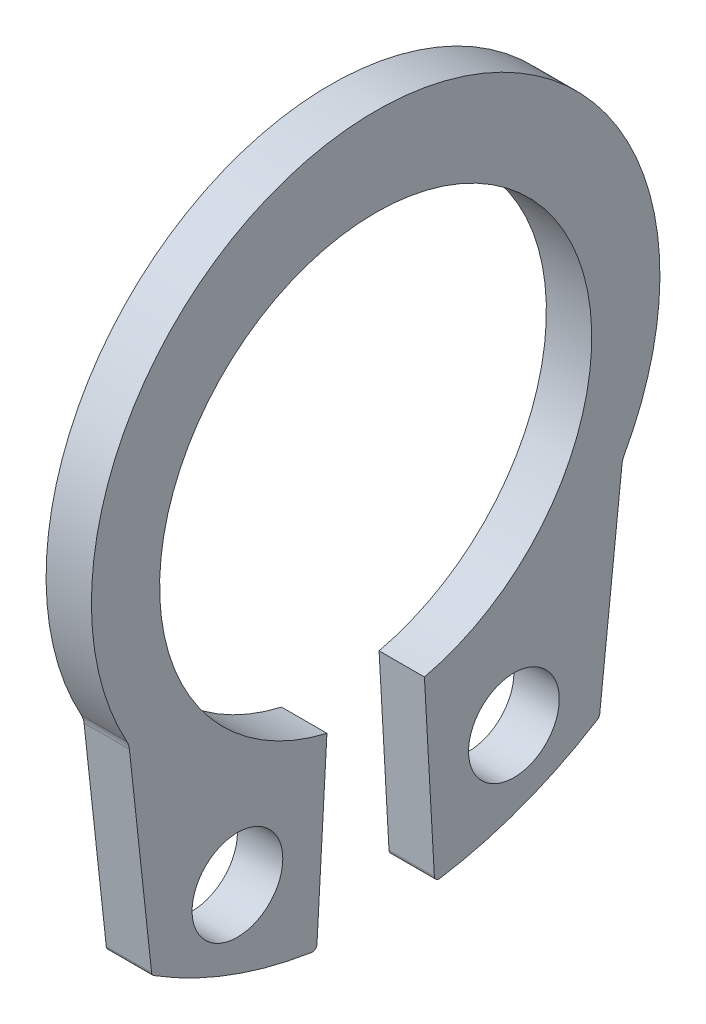
ISO-10303-21;
HEADER;
FILE_DESCRIPTION(('STEP AP214'),'2;1');
FILE_NAME('part.step','',(''),(''),'','','');
FILE_SCHEMA(('AUTOMOTIVE_DESIGN { 1 0 10303 214 1 1 1 1 }'));
ENDSEC;
DATA;
#1=APPLICATION_CONTEXT('core data for automotive mechanical design processes');
#2=APPLICATION_PROTOCOL_DEFINITION('international standard','automotive_design',2000,#1);
#3=PRODUCT_CONTEXT('',#1,'mechanical');
#4=PRODUCT('Part','Part','',(#3));
#5=PRODUCT_RELATED_PRODUCT_CATEGORY('part','',(#4));
#6=PRODUCT_DEFINITION_FORMATION('','',#4);
#7=PRODUCT_DEFINITION_CONTEXT('part definition',#1,'design');
#8=PRODUCT_DEFINITION('design','',#6,#7);
#9=PRODUCT_DEFINITION_SHAPE('','',#8);
#10=(LENGTH_UNIT() NAMED_UNIT(*) SI_UNIT(.MILLI.,.METRE.));
#11=(NAMED_UNIT(*) PLANE_ANGLE_UNIT() SI_UNIT($,.RADIAN.));
#12=(NAMED_UNIT(*) SI_UNIT($,.STERADIAN.) SOLID_ANGLE_UNIT());
#13=UNCERTAINTY_MEASURE_WITH_UNIT(LENGTH_MEASURE(1.E-05),#10,'distance_accuracy_value','');
#14=(GEOMETRIC_REPRESENTATION_CONTEXT(3) GLOBAL_UNCERTAINTY_ASSIGNED_CONTEXT((#13)) GLOBAL_UNIT_ASSIGNED_CONTEXT((#10,
#11,#12)) REPRESENTATION_CONTEXT('',''));
#15=CARTESIAN_POINT('',(0.,0.,0.));
#16=DIRECTION('',(0.,0.,1.));
#17=DIRECTION('',(1.,0.,0.));
#18=AXIS2_PLACEMENT_3D('',#15,#16,#17);
#19=CARTESIAN_POINT('',(0.85,-2.39792397685185,-5.01373537734668));
#20=DIRECTION('',(-1.,0.,0.));
#21=DIRECTION('',(0.,0.,1.));
#22=AXIS2_PLACEMENT_3D('',#19,#20,#21);
#23=CYLINDRICAL_SURFACE('',#22,0.4);
#24=CARTESIAN_POINT('',(0.85,-2.39792397685185,-5.01373537734668));
#25=DIRECTION('',(-1.,0.,0.));
#26=DIRECTION('',(0.,0.,-1.));
#27=AXIS2_PLACEMENT_3D('',#24,#25,#26);
#28=CIRCLE('',#27,0.4);
#29=CARTESIAN_POINT('',(0.85,-2.3547374993622,-4.61607355096397));
#30=VERTEX_POINT('',#29);
#31=CARTESIAN_POINT('',(0.85,-2.20449375873755,-4.6636143258227));
#32=VERTEX_POINT('',#31);
#33=EDGE_CURVE('E38',#30,#32,#28,.T.);
#34=ORIENTED_EDGE('',*,*,#33,.F.);
#35=DIRECTION('',(1.,0.,0.));
#36=VECTOR('',#35,1.);
#37=CARTESIAN_POINT('',(0.85,-2.3547374993622,-4.61607355096397));
#38=LINE('',#37,#36);
#39=CARTESIAN_POINT('',(0.,-2.3547374993622,-4.61607355096397));
#40=VERTEX_POINT('',#39);
#41=EDGE_CURVE('E248',#40,#30,#38,.T.);
#42=ORIENTED_EDGE('',*,*,#41,.F.);
#43=CARTESIAN_POINT('',(0.,-2.39792397685185,-5.01373537734668));
#44=DIRECTION('',(1.,0.,0.));
#45=DIRECTION('',(0.,0.,-1.));
#46=AXIS2_PLACEMENT_3D('',#43,#44,#45);
#47=CIRCLE('',#46,0.4);
#48=CARTESIAN_POINT('',(0.,-2.20449375873755,-4.6636143258227));
#49=VERTEX_POINT('',#48);
#50=EDGE_CURVE('E11',#49,#40,#47,.T.);
#51=ORIENTED_EDGE('',*,*,#50,.F.);
#52=DIRECTION('',(-1.,0.,0.));
#53=VECTOR('',#52,1.);
#54=CARTESIAN_POINT('',(0.85,-2.20449375873755,-4.6636143258227));
#55=LINE('',#54,#53);
#56=EDGE_CURVE('E279',#32,#49,#55,.T.);
#57=ORIENTED_EDGE('',*,*,#56,.F.);
#58=EDGE_LOOP('',(#34,#42,#51,#57));
#59=FACE_BOUND('',#58,.T.);
#60=ADVANCED_FACE('F17',(#59),#23,.F.);
#61=CARTESIAN_POINT('',(0.85,-2.39792397685184,5.01373537734669));
#62=DIRECTION('',(-1.,0.,0.));
#63=DIRECTION('',(0.,0.,1.));
#64=AXIS2_PLACEMENT_3D('',#61,#62,#63);
#65=CYLINDRICAL_SURFACE('',#64,0.4);
#66=CARTESIAN_POINT('',(0.85,-2.39792397685184,5.01373537734669));
#67=DIRECTION('',(-1.,0.,0.));
#68=DIRECTION('',(0.,0.,-1.));
#69=AXIS2_PLACEMENT_3D('',#66,#67,#68);
#70=CIRCLE('',#69,0.4);
#71=CARTESIAN_POINT('',(0.85,-2.20449375873754,4.66361432582271));
#72=VERTEX_POINT('',#71);
#73=CARTESIAN_POINT('',(0.85,-2.35473749936219,4.61607355096397));
#74=VERTEX_POINT('',#73);
#75=EDGE_CURVE('E256',#72,#74,#70,.T.);
#76=ORIENTED_EDGE('',*,*,#75,.F.);
#77=DIRECTION('',(1.,0.,0.));
#78=VECTOR('',#77,1.);
#79=CARTESIAN_POINT('',(0.85,-2.20449375873754,4.66361432582271));
#80=LINE('',#79,#78);
#81=CARTESIAN_POINT('',(0.,-2.20449375873754,4.66361432582271));
#82=VERTEX_POINT('',#81);
#83=EDGE_CURVE('E271',#82,#72,#80,.T.);
#84=ORIENTED_EDGE('',*,*,#83,.F.);
#85=CARTESIAN_POINT('',(0.,-2.39792397685184,5.01373537734669));
#86=DIRECTION('',(1.,0.,0.));
#87=DIRECTION('',(0.,0.,-1.));
#88=AXIS2_PLACEMENT_3D('',#85,#86,#87);
#89=CIRCLE('',#88,0.4);
#90=CARTESIAN_POINT('',(0.,-2.35473749936219,4.61607355096397));
#91=VERTEX_POINT('',#90);
#92=EDGE_CURVE('E20',#91,#82,#89,.T.);
#93=ORIENTED_EDGE('',*,*,#92,.F.);
#94=DIRECTION('',(-1.,0.,0.));
#95=VECTOR('',#94,1.);
#96=CARTESIAN_POINT('',(0.85,-2.35473749936219,4.61607355096397));
#97=LINE('',#96,#95);
#98=EDGE_CURVE('E176',#74,#91,#97,.T.);
#99=ORIENTED_EDGE('',*,*,#98,.F.);
#100=EDGE_LOOP('',(#76,#84,#93,#99));
#101=FACE_BOUND('',#100,.T.);
#102=ADVANCED_FACE('F272',(#101),#65,.F.);
#103=CARTESIAN_POINT('',(0.,0.,0.));
#104=DIRECTION('',(1.,0.,0.));
#105=DIRECTION('',(0.,1.,0.));
#106=AXIS2_PLACEMENT_3D('',#103,#104,#105);
#107=PLANE('',#106);
#108=CARTESIAN_POINT('',(0.,-5.56782224250959,2.59106511830008));
#109=DIRECTION('',(1.,0.,0.));
#110=DIRECTION('',(0.,0.,-1.));
#111=AXIS2_PLACEMENT_3D('',#108,#109,#110);
#112=CIRCLE('',#111,0.85);
#113=CARTESIAN_POINT('',(0.,-5.56782224250959,1.74106511830008));
#114=VERTEX_POINT('',#113);
#115=EDGE_CURVE('E315',#114,#114,#112,.T.);
#116=ORIENTED_EDGE('',*,*,#115,.T.);
#117=EDGE_LOOP('',(#116));
#118=FACE_BOUND('',#117,.T.);
#119=CARTESIAN_POINT('',(0.,-5.56782224250959,-2.59106511830008));
#120=DIRECTION('',(-1.,0.,0.));
#121=DIRECTION('',(0.,0.,-1.));
#122=AXIS2_PLACEMENT_3D('',#119,#120,#121);
#123=CIRCLE('',#122,0.85);
#124=CARTESIAN_POINT('',(0.,-5.56782224250959,-3.44106511830008));
#125=VERTEX_POINT('',#124);
#126=EDGE_CURVE('E353',#125,#125,#123,.T.);
#127=ORIENTED_EDGE('',*,*,#126,.F.);
#128=EDGE_LOOP('',(#127));
#129=FACE_BOUND('',#128,.T.);
#130=DIRECTION('',(0.,0.994154565956785,0.107966193724127));
#131=VECTOR('',#130,1.);
#132=CARTESIAN_POINT('',(0.,-0.522915110689556,4.81501131945199));
#133=LINE('',#132,#131);
#134=CARTESIAN_POINT('',(0.,-6.19075573329271,4.19947808185275));
#135=VERTEX_POINT('',#134);
#136=EDGE_CURVE('E154',#135,#91,#133,.T.);
#137=ORIENTED_EDGE('',*,*,#136,.T.);
#138=ORIENTED_EDGE('',*,*,#92,.T.);
#139=CARTESIAN_POINT('',(0.,0.371997807017542,0.));
#140=DIRECTION('',(1.,0.,0.));
#141=DIRECTION('',(0.,0.,-1.));
#142=AXIS2_PLACEMENT_3D('',#139,#140,#141);
#143=CIRCLE('',#142,5.32800219298246);
#144=EDGE_CURVE('E267',#49,#82,#143,.T.);
#145=ORIENTED_EDGE('',*,*,#144,.F.);
#146=ORIENTED_EDGE('',*,*,#50,.T.);
#147=DIRECTION('',(0.,0.994154565956785,-0.107966193724126));
#148=VECTOR('',#147,1.);
#149=CARTESIAN_POINT('',(0.,-0.522915110689551,-4.81501131945199));
#150=LINE('',#149,#148);
#151=CARTESIAN_POINT('',(0.,-6.19075573329271,-4.19947808185275));
#152=VERTEX_POINT('',#151);
#153=EDGE_CURVE('E244',#152,#40,#150,.T.);
#154=ORIENTED_EDGE('',*,*,#153,.F.);
#155=CARTESIAN_POINT('',(0.,-6.1811158134206,-4.11071353412026));
#156=DIRECTION('',(-1.,0.,0.));
#157=DIRECTION('',(0.,0.,-1.));
#158=AXIS2_PLACEMENT_3D('',#155,#156,#157);
#159=CIRCLE('',#158,0.0892864658797376);
#160=CARTESIAN_POINT('',(0.,-6.25675257958271,-4.15815984687302));
#161=VERTEX_POINT('',#160);
#162=EDGE_CURVE('E190',#152,#161,#159,.T.);
#163=ORIENTED_EDGE('',*,*,#162,.T.);
#164=CARTESIAN_POINT('',(0.,0.371997807017542,0.));
#165=DIRECTION('',(1.,0.,0.));
#166=DIRECTION('',(0.,0.,-1.));
#167=AXIS2_PLACEMENT_3D('',#164,#165,#166);
#168=CIRCLE('',#167,7.825);
#169=CARTESIAN_POINT('',(0.,-7.35997373313335,-1.20301334252644));
#170=VERTEX_POINT('',#169);
#171=EDGE_CURVE('E232',#170,#161,#168,.T.);
#172=ORIENTED_EDGE('',*,*,#171,.F.);
#173=CARTESIAN_POINT('',(0.,-7.27174876021286,-1.18928646587975));
#174=DIRECTION('',(-1.,0.,0.));
#175=DIRECTION('',(0.,0.,-1.));
#176=AXIS2_PLACEMENT_3D('',#173,#174,#175);
#177=CIRCLE('',#176,0.0892864658797398);
#178=CARTESIAN_POINT('',(0.,-7.27674135002132,-1.1001396934407));
#179=VERTEX_POINT('',#178);
#180=EDGE_CURVE('E226',#170,#179,#177,.T.);
#181=ORIENTED_EDGE('',*,*,#180,.T.);
#182=DIRECTION('',(0.,0.998435446634371,0.0559165351575345));
#183=VECTOR('',#182,1.);
#184=CARTESIAN_POINT('',(0.,0.0386678666475541,-0.690446369716576));
#185=LINE('',#184,#183);
#186=CARTESIAN_POINT('',(0.,-3.94561359779142,-0.913582692985955));
#187=VERTEX_POINT('',#186);
#188=EDGE_CURVE('E218',#179,#187,#185,.T.);
#189=ORIENTED_EDGE('',*,*,#188,.T.);
#190=CARTESIAN_POINT('',(0.,0.,0.));
#191=DIRECTION('',(1.,0.,0.));
#192=DIRECTION('',(0.,0.,-1.));
#193=AXIS2_PLACEMENT_3D('',#190,#191,#192);
#194=CIRCLE('',#193,4.05);
#195=CARTESIAN_POINT('',(0.,-3.94561359779142,0.913582692985955));
#196=VERTEX_POINT('',#195);
#197=EDGE_CURVE('E295',#187,#196,#194,.T.);
#198=ORIENTED_EDGE('',*,*,#197,.T.);
#199=DIRECTION('',(0.,0.998435446634371,-0.0559165351575343));
#200=VECTOR('',#199,1.);
#201=CARTESIAN_POINT('',(0.,0.0386678666475539,0.690446369716574));
#202=LINE('',#201,#200);
#203=CARTESIAN_POINT('',(0.,-7.27674135002132,1.1001396934407));
#204=VERTEX_POINT('',#203);
#205=EDGE_CURVE('E217',#204,#196,#202,.T.);
#206=ORIENTED_EDGE('',*,*,#205,.F.);
#207=CARTESIAN_POINT('',(0.,-7.27174876021286,1.18928646587974));
#208=DIRECTION('',(1.,0.,0.));
#209=DIRECTION('',(0.,0.,-1.));
#210=AXIS2_PLACEMENT_3D('',#207,#208,#209);
#211=CIRCLE('',#210,0.0892864658797448);
#212=CARTESIAN_POINT('',(0.,-7.35997373313335,1.20301334252644));
#213=VERTEX_POINT('',#212);
#214=EDGE_CURVE('E205',#213,#204,#211,.T.);
#215=ORIENTED_EDGE('',*,*,#214,.F.);
#216=CARTESIAN_POINT('',(0.,0.371997807017542,0.));
#217=DIRECTION('',(1.,0.,0.));
#218=DIRECTION('',(0.,0.,-1.));
#219=AXIS2_PLACEMENT_3D('',#216,#217,#218);
#220=CIRCLE('',#219,7.825);
#221=CARTESIAN_POINT('',(0.,-6.25675257958271,4.15815984687302));
#222=VERTEX_POINT('',#221);
#223=EDGE_CURVE('E157',#222,#213,#220,.T.);
#224=ORIENTED_EDGE('',*,*,#223,.F.);
#225=CARTESIAN_POINT('',(0.,-6.1811158134206,4.11071353412026));
#226=DIRECTION('',(1.,0.,0.));
#227=DIRECTION('',(0.,0.,-1.));
#228=AXIS2_PLACEMENT_3D('',#225,#226,#227);
#229=CIRCLE('',#228,0.0892864658797463);
#230=EDGE_CURVE('E150',#135,#222,#229,.T.);
#231=ORIENTED_EDGE('',*,*,#230,.F.);
#232=EDGE_LOOP('',(#137,#138,#145,#146,#154,#163,#172,#181,#189,#198,#206,#215,#224,#231));
#233=FACE_BOUND('',#232,.T.);
#234=ADVANCED_FACE('F152',(#118,#129,#233),#107,.F.);
#235=CARTESIAN_POINT('',(0.85,0.,0.));
#236=DIRECTION('',(1.,0.,0.));
#237=DIRECTION('',(0.,1.,0.));
#238=AXIS2_PLACEMENT_3D('',#235,#236,#237);
#239=PLANE('',#238);
#240=CARTESIAN_POINT('',(0.85,-5.56782224250959,2.59106511830008));
#241=DIRECTION('',(1.,0.,0.));
#242=DIRECTION('',(0.,0.,-1.));
#243=AXIS2_PLACEMENT_3D('',#240,#241,#242);
#244=CIRCLE('',#243,0.85);
#245=CARTESIAN_POINT('',(0.85,-5.56782224250959,1.74106511830008));
#246=VERTEX_POINT('',#245);
#247=EDGE_CURVE('E319',#246,#246,#244,.T.);
#248=ORIENTED_EDGE('',*,*,#247,.F.);
#249=EDGE_LOOP('',(#248));
#250=FACE_BOUND('',#249,.T.);
#251=CARTESIAN_POINT('',(0.85,-5.56782224250959,-2.59106511830008));
#252=DIRECTION('',(-1.,0.,0.));
#253=DIRECTION('',(0.,0.,-1.));
#254=AXIS2_PLACEMENT_3D('',#251,#252,#253);
#255=CIRCLE('',#254,0.85);
#256=CARTESIAN_POINT('',(0.85,-5.56782224250959,-3.44106511830008));
#257=VERTEX_POINT('',#256);
#258=EDGE_CURVE('E349',#257,#257,#255,.T.);
#259=ORIENTED_EDGE('',*,*,#258,.T.);
#260=EDGE_LOOP('',(#259));
#261=FACE_BOUND('',#260,.T.);
#262=DIRECTION('',(0.,0.994154565956785,0.107966193724127));
#263=VECTOR('',#262,1.);
#264=CARTESIAN_POINT('',(0.85,-0.522915110689556,4.81501131945199));
#265=LINE('',#264,#263);
#266=CARTESIAN_POINT('',(0.85,-6.19075573329271,4.19947808185275));
#267=VERTEX_POINT('',#266);
#268=EDGE_CURVE('E183',#267,#74,#265,.T.);
#269=ORIENTED_EDGE('',*,*,#268,.F.);
#270=CARTESIAN_POINT('',(0.85,-6.1811158134206,4.11071353412026));
#271=DIRECTION('',(1.,0.,0.));
#272=DIRECTION('',(0.,0.,-1.));
#273=AXIS2_PLACEMENT_3D('',#270,#271,#272);
#274=CIRCLE('',#273,0.0892864658797463);
#275=CARTESIAN_POINT('',(0.85,-6.25675257958271,4.15815984687302));
#276=VERTEX_POINT('',#275);
#277=EDGE_CURVE('E168',#267,#276,#274,.T.);
#278=ORIENTED_EDGE('',*,*,#277,.T.);
#279=CARTESIAN_POINT('',(0.85,0.371997807017542,0.));
#280=DIRECTION('',(1.,0.,0.));
#281=DIRECTION('',(0.,0.,-1.));
#282=AXIS2_PLACEMENT_3D('',#279,#280,#281);
#283=CIRCLE('',#282,7.825);
#284=CARTESIAN_POINT('',(0.85,-7.35997373313335,1.20301334252644));
#285=VERTEX_POINT('',#284);
#286=EDGE_CURVE('E201',#276,#285,#283,.T.);
#287=ORIENTED_EDGE('',*,*,#286,.T.);
#288=CARTESIAN_POINT('',(0.85,-7.27174876021286,1.18928646587974));
#289=DIRECTION('',(1.,0.,0.));
#290=DIRECTION('',(0.,0.,-1.));
#291=AXIS2_PLACEMENT_3D('',#288,#289,#290);
#292=CIRCLE('',#291,0.0892864658797448);
#293=CARTESIAN_POINT('',(0.85,-7.27674135002132,1.1001396934407));
#294=VERTEX_POINT('',#293);
#295=EDGE_CURVE('E213',#285,#294,#292,.T.);
#296=ORIENTED_EDGE('',*,*,#295,.T.);
#297=DIRECTION('',(0.,0.998435446634371,-0.0559165351575343));
#298=VECTOR('',#297,1.);
#299=CARTESIAN_POINT('',(0.85,0.0386678666475539,0.690446369716574));
#300=LINE('',#299,#298);
#301=CARTESIAN_POINT('',(0.85,-3.94561359779142,0.913582692985955));
#302=VERTEX_POINT('',#301);
#303=EDGE_CURVE('E222',#294,#302,#300,.T.);
#304=ORIENTED_EDGE('',*,*,#303,.T.);
#305=CARTESIAN_POINT('',(0.85,0.,0.));
#306=DIRECTION('',(1.,0.,0.));
#307=DIRECTION('',(0.,0.,-1.));
#308=AXIS2_PLACEMENT_3D('',#305,#306,#307);
#309=CIRCLE('',#308,4.05);
#310=CARTESIAN_POINT('',(0.85,-3.94561359779142,-0.913582692985955));
#311=VERTEX_POINT('',#310);
#312=EDGE_CURVE('E276',#311,#302,#309,.T.);
#313=ORIENTED_EDGE('',*,*,#312,.F.);
#314=DIRECTION('',(0.,0.998435446634371,0.0559165351575345));
#315=VECTOR('',#314,1.);
#316=CARTESIAN_POINT('',(0.85,0.0386678666475541,-0.690446369716576));
#317=LINE('',#316,#315);
#318=CARTESIAN_POINT('',(0.85,-7.27674135002132,-1.1001396934407));
#319=VERTEX_POINT('',#318);
#320=EDGE_CURVE('E223',#319,#311,#317,.T.);
#321=ORIENTED_EDGE('',*,*,#320,.F.);
#322=CARTESIAN_POINT('',(0.85,-7.27174876021286,-1.18928646587975));
#323=DIRECTION('',(-1.,0.,0.));
#324=DIRECTION('',(0.,0.,-1.));
#325=AXIS2_PLACEMENT_3D('',#322,#323,#324);
#326=CIRCLE('',#325,0.0892864658797398);
#327=CARTESIAN_POINT('',(0.85,-7.35997373313335,-1.20301334252644));
#328=VERTEX_POINT('',#327);
#329=EDGE_CURVE('E229',#328,#319,#326,.T.);
#330=ORIENTED_EDGE('',*,*,#329,.F.);
#331=CARTESIAN_POINT('',(0.85,0.371997807017542,0.));
#332=DIRECTION('',(1.,0.,0.));
#333=DIRECTION('',(0.,0.,-1.));
#334=AXIS2_PLACEMENT_3D('',#331,#332,#333);
#335=CIRCLE('',#334,7.825);
#336=CARTESIAN_POINT('',(0.85,-6.25675257958271,-4.15815984687302));
#337=VERTEX_POINT('',#336);
#338=EDGE_CURVE('E194',#328,#337,#335,.T.);
#339=ORIENTED_EDGE('',*,*,#338,.T.);
#340=CARTESIAN_POINT('',(0.85,-6.1811158134206,-4.11071353412026));
#341=DIRECTION('',(-1.,0.,0.));
#342=DIRECTION('',(0.,0.,-1.));
#343=AXIS2_PLACEMENT_3D('',#340,#341,#342);
#344=CIRCLE('',#343,0.0892864658797376);
#345=CARTESIAN_POINT('',(0.85,-6.19075573329271,-4.19947808185275));
#346=VERTEX_POINT('',#345);
#347=EDGE_CURVE('E243',#346,#337,#344,.T.);
#348=ORIENTED_EDGE('',*,*,#347,.F.);
#349=DIRECTION('',(0.,0.994154565956785,-0.107966193724126));
#350=VECTOR('',#349,1.);
#351=CARTESIAN_POINT('',(0.85,-0.522915110689551,-4.81501131945199));
#352=LINE('',#351,#350);
#353=EDGE_CURVE('E252',#346,#30,#352,.T.);
#354=ORIENTED_EDGE('',*,*,#353,.T.);
#355=ORIENTED_EDGE('',*,*,#33,.T.);
#356=CARTESIAN_POINT('',(0.85,0.371997807017542,0.));
#357=DIRECTION('',(1.,0.,0.));
#358=DIRECTION('',(0.,0.,-1.));
#359=AXIS2_PLACEMENT_3D('',#356,#357,#358);
#360=CIRCLE('',#359,5.32800219298246);
#361=EDGE_CURVE('E285',#32,#72,#360,.T.);
#362=ORIENTED_EDGE('',*,*,#361,.T.);
#363=ORIENTED_EDGE('',*,*,#75,.T.);
#364=EDGE_LOOP('',(#269,#278,#287,#296,#304,#313,#321,#330,#339,#348,#354,#355,#362,#363));
#365=FACE_BOUND('',#364,.T.);
#366=ADVANCED_FACE('F336',(#250,#261,#365),#239,.T.);
#367=CARTESIAN_POINT('',(0.85,-0.522915110689551,-4.81501131945199));
#368=DIRECTION('',(0.,0.107966193724126,0.994154565956785));
#369=DIRECTION('',(1.,0.,0.));
#370=AXIS2_PLACEMENT_3D('',#367,#368,#369);
#371=PLANE('',#370);
#372=ORIENTED_EDGE('',*,*,#153,.T.);
#373=ORIENTED_EDGE('',*,*,#41,.T.);
#374=ORIENTED_EDGE('',*,*,#353,.F.);
#375=DIRECTION('',(-1.,0.,0.));
#376=VECTOR('',#375,1.);
#377=CARTESIAN_POINT('',(0.85,-6.19075573329271,-4.19947808185275));
#378=LINE('',#377,#376);
#379=EDGE_CURVE('E193',#346,#152,#378,.T.);
#380=ORIENTED_EDGE('',*,*,#379,.T.);
#381=EDGE_LOOP('',(#372,#373,#374,#380));
#382=FACE_BOUND('',#381,.T.);
#383=ADVANCED_FACE('F394',(#382),#371,.F.);
#384=CARTESIAN_POINT('',(0.85,-6.1811158134206,-4.11071353412026));
#385=DIRECTION('',(-1.,0.,0.));
#386=DIRECTION('',(0.,0.,1.));
#387=AXIS2_PLACEMENT_3D('',#384,#385,#386);
#388=CYLINDRICAL_SURFACE('',#387,0.0892864658797376);
#389=ORIENTED_EDGE('',*,*,#162,.F.);
#390=ORIENTED_EDGE('',*,*,#379,.F.);
#391=ORIENTED_EDGE('',*,*,#347,.T.);
#392=DIRECTION('',(-1.,0.,0.));
#393=VECTOR('',#392,1.);
#394=CARTESIAN_POINT('',(0.85,-6.25675257958271,-4.15815984687302));
#395=LINE('',#394,#393);
#396=EDGE_CURVE('E236',#337,#161,#395,.T.);
#397=ORIENTED_EDGE('',*,*,#396,.T.);
#398=EDGE_LOOP('',(#389,#390,#391,#397));
#399=FACE_BOUND('',#398,.T.);
#400=ADVANCED_FACE('F391',(#399),#388,.T.);
#401=CARTESIAN_POINT('',(0.85,0.371997807017542,0.));
#402=DIRECTION('',(-1.,0.,0.));
#403=DIRECTION('',(0.,0.,1.));
#404=AXIS2_PLACEMENT_3D('',#401,#402,#403);
#405=CYLINDRICAL_SURFACE('',#404,7.825);
#406=ORIENTED_EDGE('',*,*,#171,.T.);
#407=ORIENTED_EDGE('',*,*,#396,.F.);
#408=ORIENTED_EDGE('',*,*,#338,.F.);
#409=DIRECTION('',(-1.,0.,0.));
#410=VECTOR('',#409,1.);
#411=CARTESIAN_POINT('',(0.85,-7.35997373313335,-1.20301334252644));
#412=LINE('',#411,#410);
#413=EDGE_CURVE('E186',#328,#170,#412,.T.);
#414=ORIENTED_EDGE('',*,*,#413,.T.);
#415=EDGE_LOOP('',(#406,#407,#408,#414));
#416=FACE_BOUND('',#415,.T.);
#417=ADVANCED_FACE('F389',(#416),#405,.T.);
#418=CARTESIAN_POINT('',(0.85,-7.27174876021286,-1.18928646587975));
#419=DIRECTION('',(-1.,0.,0.));
#420=DIRECTION('',(0.,0.,1.));
#421=AXIS2_PLACEMENT_3D('',#418,#419,#420);
#422=CYLINDRICAL_SURFACE('',#421,0.0892864658797398);
#423=ORIENTED_EDGE('',*,*,#180,.F.);
#424=ORIENTED_EDGE('',*,*,#413,.F.);
#425=ORIENTED_EDGE('',*,*,#329,.T.);
#426=DIRECTION('',(-1.,0.,0.));
#427=VECTOR('',#426,1.);
#428=CARTESIAN_POINT('',(0.85,-7.27674135002132,-1.1001396934407));
#429=LINE('',#428,#427);
#430=EDGE_CURVE('E221',#319,#179,#429,.T.);
#431=ORIENTED_EDGE('',*,*,#430,.T.);
#432=EDGE_LOOP('',(#423,#424,#425,#431));
#433=FACE_BOUND('',#432,.T.);
#434=ADVANCED_FACE('F427',(#433),#422,.T.);
#435=CARTESIAN_POINT('',(0.85,0.0386678666475541,-0.690446369716576));
#436=DIRECTION('',(0.,-0.0559165351575345,0.998435446634371));
#437=DIRECTION('',(-1.,0.,0.));
#438=AXIS2_PLACEMENT_3D('',#435,#436,#437);
#439=PLANE('',#438);
#440=ORIENTED_EDGE('',*,*,#188,.F.);
#441=ORIENTED_EDGE('',*,*,#430,.F.);
#442=ORIENTED_EDGE('',*,*,#320,.T.);
#443=DIRECTION('',(-1.,0.,0.));
#444=VECTOR('',#443,1.);
#445=CARTESIAN_POINT('',(0.85,-3.94561359779142,-0.913582692985955));
#446=LINE('',#445,#444);
#447=EDGE_CURVE('E292',#311,#187,#446,.T.);
#448=ORIENTED_EDGE('',*,*,#447,.T.);
#449=EDGE_LOOP('',(#440,#441,#442,#448));
#450=FACE_BOUND('',#449,.T.);
#451=ADVANCED_FACE('F435',(#450),#439,.T.);
#452=CARTESIAN_POINT('',(0.85,0.0386678666475539,0.690446369716574));
#453=DIRECTION('',(0.,0.0559165351575343,0.998435446634371));
#454=DIRECTION('',(1.,0.,0.));
#455=AXIS2_PLACEMENT_3D('',#452,#453,#454);
#456=PLANE('',#455);
#457=ORIENTED_EDGE('',*,*,#205,.T.);
#458=DIRECTION('',(-1.,0.,0.));
#459=VECTOR('',#458,1.);
#460=CARTESIAN_POINT('',(0.85,-3.94561359779142,0.913582692985955));
#461=LINE('',#460,#459);
#462=EDGE_CURVE('E305',#302,#196,#461,.T.);
#463=ORIENTED_EDGE('',*,*,#462,.F.);
#464=ORIENTED_EDGE('',*,*,#303,.F.);
#465=DIRECTION('',(-1.,0.,0.));
#466=VECTOR('',#465,1.);
#467=CARTESIAN_POINT('',(0.85,-7.27674135002132,1.1001396934407));
#468=LINE('',#467,#466);
#469=EDGE_CURVE('E209',#294,#204,#468,.T.);
#470=ORIENTED_EDGE('',*,*,#469,.T.);
#471=EDGE_LOOP('',(#457,#463,#464,#470));
#472=FACE_BOUND('',#471,.T.);
#473=ADVANCED_FACE('F340',(#472),#456,.F.);
#474=CARTESIAN_POINT('',(0.85,-7.27174876021286,1.18928646587974));
#475=DIRECTION('',(-1.,0.,0.));
#476=DIRECTION('',(0.,0.,1.));
#477=AXIS2_PLACEMENT_3D('',#474,#475,#476);
#478=CYLINDRICAL_SURFACE('',#477,0.0892864658797448);
#479=ORIENTED_EDGE('',*,*,#214,.T.);
#480=ORIENTED_EDGE('',*,*,#469,.F.);
#481=ORIENTED_EDGE('',*,*,#295,.F.);
#482=DIRECTION('',(-1.,0.,0.));
#483=VECTOR('',#482,1.);
#484=CARTESIAN_POINT('',(0.85,-7.35997373313335,1.20301334252644));
#485=LINE('',#484,#483);
#486=EDGE_CURVE('E197',#285,#213,#485,.T.);
#487=ORIENTED_EDGE('',*,*,#486,.T.);
#488=EDGE_LOOP('',(#479,#480,#481,#487));
#489=FACE_BOUND('',#488,.T.);
#490=ADVANCED_FACE('F450',(#489),#478,.T.);
#491=CARTESIAN_POINT('',(0.85,0.371997807017542,0.));
#492=DIRECTION('',(-1.,0.,0.));
#493=DIRECTION('',(0.,0.,1.));
#494=AXIS2_PLACEMENT_3D('',#491,#492,#493);
#495=CYLINDRICAL_SURFACE('',#494,7.825);
#496=ORIENTED_EDGE('',*,*,#223,.T.);
#497=ORIENTED_EDGE('',*,*,#486,.F.);
#498=ORIENTED_EDGE('',*,*,#286,.F.);
#499=DIRECTION('',(-1.,0.,0.));
#500=VECTOR('',#499,1.);
#501=CARTESIAN_POINT('',(0.85,-6.25675257958271,4.15815984687302));
#502=LINE('',#501,#500);
#503=EDGE_CURVE('E162',#276,#222,#502,.T.);
#504=ORIENTED_EDGE('',*,*,#503,.T.);
#505=EDGE_LOOP('',(#496,#497,#498,#504));
#506=FACE_BOUND('',#505,.T.);
#507=ADVANCED_FACE('F458',(#506),#495,.T.);
#508=CARTESIAN_POINT('',(0.85,-6.1811158134206,4.11071353412026));
#509=DIRECTION('',(-1.,0.,0.));
#510=DIRECTION('',(0.,0.,1.));
#511=AXIS2_PLACEMENT_3D('',#508,#509,#510);
#512=CYLINDRICAL_SURFACE('',#511,0.0892864658797463);
#513=ORIENTED_EDGE('',*,*,#230,.T.);
#514=ORIENTED_EDGE('',*,*,#503,.F.);
#515=ORIENTED_EDGE('',*,*,#277,.F.);
#516=DIRECTION('',(-1.,0.,0.));
#517=VECTOR('',#516,1.);
#518=CARTESIAN_POINT('',(0.85,-6.19075573329271,4.19947808185275));
#519=LINE('',#518,#517);
#520=EDGE_CURVE('E163',#267,#135,#519,.T.);
#521=ORIENTED_EDGE('',*,*,#520,.T.);
#522=EDGE_LOOP('',(#513,#514,#515,#521));
#523=FACE_BOUND('',#522,.T.);
#524=ADVANCED_FACE('F166',(#523),#512,.T.);
#525=CARTESIAN_POINT('',(0.85,-0.522915110689556,4.81501131945199));
#526=DIRECTION('',(0.,-0.107966193724127,0.994154565956785));
#527=DIRECTION('',(-1.,0.,0.));
#528=AXIS2_PLACEMENT_3D('',#525,#526,#527);
#529=PLANE('',#528);
#530=ORIENTED_EDGE('',*,*,#268,.T.);
#531=ORIENTED_EDGE('',*,*,#98,.T.);
#532=ORIENTED_EDGE('',*,*,#136,.F.);
#533=ORIENTED_EDGE('',*,*,#520,.F.);
#534=EDGE_LOOP('',(#530,#531,#532,#533));
#535=FACE_BOUND('',#534,.T.);
#536=ADVANCED_FACE('F174',(#535),#529,.T.);
#537=CARTESIAN_POINT('',(0.85,0.,0.));
#538=DIRECTION('',(-1.,0.,0.));
#539=DIRECTION('',(0.,1.,0.));
#540=AXIS2_PLACEMENT_3D('',#537,#538,#539);
#541=CYLINDRICAL_SURFACE('',#540,4.05);
#542=ORIENTED_EDGE('',*,*,#312,.T.);
#543=ORIENTED_EDGE('',*,*,#462,.T.);
#544=ORIENTED_EDGE('',*,*,#197,.F.);
#545=ORIENTED_EDGE('',*,*,#447,.F.);
#546=EDGE_LOOP('',(#542,#543,#544,#545));
#547=FACE_BOUND('',#546,.T.);
#548=ADVANCED_FACE('F342',(#547),#541,.F.);
#549=CARTESIAN_POINT('',(0.85,0.371997807017542,0.));
#550=DIRECTION('',(-1.,0.,0.));
#551=DIRECTION('',(0.,1.,0.));
#552=AXIS2_PLACEMENT_3D('',#549,#550,#551);
#553=CYLINDRICAL_SURFACE('',#552,5.32800219298246);
#554=ORIENTED_EDGE('',*,*,#361,.F.);
#555=ORIENTED_EDGE('',*,*,#56,.T.);
#556=ORIENTED_EDGE('',*,*,#144,.T.);
#557=ORIENTED_EDGE('',*,*,#83,.T.);
#558=EDGE_LOOP('',(#554,#555,#556,#557));
#559=FACE_BOUND('',#558,.T.);
#560=ADVANCED_FACE('F278',(#559),#553,.T.);
#561=CARTESIAN_POINT('',(0.85,-5.56782224250959,2.59106511830008));
#562=DIRECTION('',(-1.,0.,0.));
#563=DIRECTION('',(0.,0.,1.));
#564=AXIS2_PLACEMENT_3D('',#561,#562,#563);
#565=CYLINDRICAL_SURFACE('',#564,0.85);
#566=ORIENTED_EDGE('',*,*,#115,.F.);
#567=EDGE_LOOP('',(#566));
#568=FACE_BOUND('',#567,.T.);
#569=ORIENTED_EDGE('',*,*,#247,.T.);
#570=EDGE_LOOP('',(#569));
#571=FACE_BOUND('',#570,.T.);
#572=ADVANCED_FACE('F369',(#568,#571),#565,.F.);
#573=CARTESIAN_POINT('',(0.85,-5.56782224250959,-2.59106511830008));
#574=DIRECTION('',(-1.,0.,0.));
#575=DIRECTION('',(0.,0.,1.));
#576=AXIS2_PLACEMENT_3D('',#573,#574,#575);
#577=CYLINDRICAL_SURFACE('',#576,0.85);
#578=ORIENTED_EDGE('',*,*,#126,.T.);
#579=EDGE_LOOP('',(#578));
#580=FACE_BOUND('',#579,.T.);
#581=ORIENTED_EDGE('',*,*,#258,.F.);
#582=EDGE_LOOP('',(#581));
#583=FACE_BOUND('',#582,.T.);
#584=ADVANCED_FACE('F367',(#580,#583),#577,.F.);
#585=CLOSED_SHELL('',(#60,#102,#234,#366,#383,#400,#417,#434,#451,#473,#490,#507,#524,#536,#548,
#560,#572,#584));
#586=MANIFOLD_SOLID_BREP('B1',#585);
#587=ADVANCED_BREP_SHAPE_REPRESENTATION('',(#18,#586),#14);
#588=SHAPE_DEFINITION_REPRESENTATION(#9,#587);
ENDSEC;
END-ISO-10303-21;
